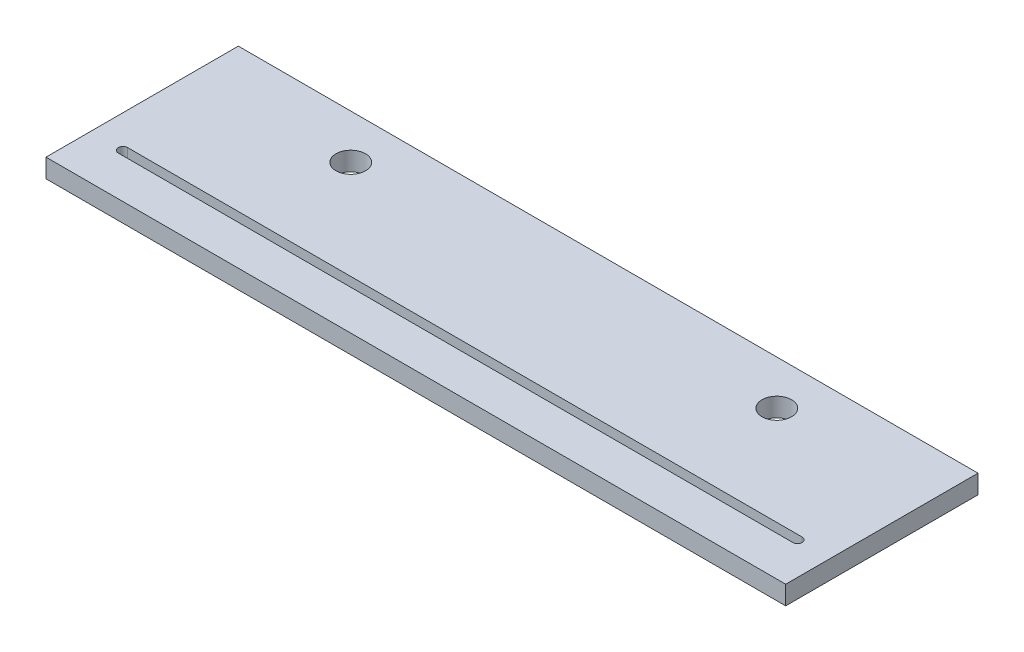
ISO-10303-21;
HEADER;
FILE_DESCRIPTION(('STEP AP214'),'2;1');
FILE_NAME('part.step','',(''),(''),'','','');
FILE_SCHEMA(('AUTOMOTIVE_DESIGN { 1 0 10303 214 1 1 1 1 }'));
ENDSEC;
DATA;
#1=APPLICATION_CONTEXT('core data for automotive mechanical design processes');
#2=APPLICATION_PROTOCOL_DEFINITION('international standard','automotive_design',2000,#1);
#3=PRODUCT_CONTEXT('',#1,'mechanical');
#4=PRODUCT('Part','Part','',(#3));
#5=PRODUCT_RELATED_PRODUCT_CATEGORY('part','',(#4));
#6=PRODUCT_DEFINITION_FORMATION('','',#4);
#7=PRODUCT_DEFINITION_CONTEXT('part definition',#1,'design');
#8=PRODUCT_DEFINITION('design','',#6,#7);
#9=PRODUCT_DEFINITION_SHAPE('','',#8);
#10=(LENGTH_UNIT() NAMED_UNIT(*) SI_UNIT(.MILLI.,.METRE.));
#11=(NAMED_UNIT(*) PLANE_ANGLE_UNIT() SI_UNIT($,.RADIAN.));
#12=(NAMED_UNIT(*) SI_UNIT($,.STERADIAN.) SOLID_ANGLE_UNIT());
#13=UNCERTAINTY_MEASURE_WITH_UNIT(LENGTH_MEASURE(1.E-05),#10,'distance_accuracy_value','');
#14=(GEOMETRIC_REPRESENTATION_CONTEXT(3) GLOBAL_UNCERTAINTY_ASSIGNED_CONTEXT((#13)) GLOBAL_UNIT_ASSIGNED_CONTEXT((#10,
#11,#12)) REPRESENTATION_CONTEXT('',''));
#15=CARTESIAN_POINT('',(0.,0.,0.));
#16=DIRECTION('',(0.,0.,1.));
#17=DIRECTION('',(1.,0.,0.));
#18=AXIS2_PLACEMENT_3D('',#15,#16,#17);
#19=CARTESIAN_POINT('',(-125.,6.35,-25.));
#20=DIRECTION('',(0.,0.,1.));
#21=DIRECTION('',(1.,0.,0.));
#22=AXIS2_PLACEMENT_3D('',#19,#20,#21);
#23=PLANE('',#22);
#24=DIRECTION('',(-1.,0.,0.));
#25=VECTOR('',#24,1.);
#26=CARTESIAN_POINT('',(-125.,0.,-25.));
#27=LINE('',#26,#25);
#28=CARTESIAN_POINT('',(125.,0.,-25.));
#29=VERTEX_POINT('',#28);
#30=CARTESIAN_POINT('',(-125.,0.,-25.));
#31=VERTEX_POINT('',#30);
#32=EDGE_CURVE('E134',#29,#31,#27,.T.);
#33=ORIENTED_EDGE('',*,*,#32,.T.);
#34=DIRECTION('',(0.,-1.,0.));
#35=VECTOR('',#34,1.);
#36=CARTESIAN_POINT('',(-125.,6.35,-25.));
#37=LINE('',#36,#35);
#38=CARTESIAN_POINT('',(-125.,6.35,-25.));
#39=VERTEX_POINT('',#38);
#40=EDGE_CURVE('E40',#39,#31,#37,.T.);
#41=ORIENTED_EDGE('',*,*,#40,.F.);
#42=DIRECTION('',(-1.,0.,0.));
#43=VECTOR('',#42,1.);
#44=CARTESIAN_POINT('',(-125.,6.35,-25.));
#45=LINE('',#44,#43);
#46=CARTESIAN_POINT('',(125.,6.35,-25.));
#47=VERTEX_POINT('',#46);
#48=EDGE_CURVE('E141',#47,#39,#45,.T.);
#49=ORIENTED_EDGE('',*,*,#48,.F.);
#50=DIRECTION('',(0.,-1.,0.));
#51=VECTOR('',#50,1.);
#52=CARTESIAN_POINT('',(125.,6.35,-25.));
#53=LINE('',#52,#51);
#54=EDGE_CURVE('E11',#47,#29,#53,.T.);
#55=ORIENTED_EDGE('',*,*,#54,.T.);
#56=EDGE_LOOP('',(#33,#41,#49,#55));
#57=FACE_BOUND('',#56,.T.);
#58=ADVANCED_FACE('F33',(#57),#23,.F.);
#59=CARTESIAN_POINT('',(-125.,6.35,25.));
#60=DIRECTION('',(1.,0.,0.));
#61=DIRECTION('',(0.,0.,-1.));
#62=AXIS2_PLACEMENT_3D('',#59,#60,#61);
#63=PLANE('',#62);
#64=DIRECTION('',(0.,0.,1.));
#65=VECTOR('',#64,1.);
#66=CARTESIAN_POINT('',(-125.,0.,25.));
#67=LINE('',#66,#65);
#68=CARTESIAN_POINT('',(-125.,0.,40.));
#69=VERTEX_POINT('',#68);
#70=EDGE_CURVE('E152',#31,#69,#67,.T.);
#71=ORIENTED_EDGE('',*,*,#70,.T.);
#72=DIRECTION('',(0.,-1.,0.));
#73=VECTOR('',#72,1.);
#74=CARTESIAN_POINT('',(-125.,6.35,40.));
#75=LINE('',#74,#73);
#76=CARTESIAN_POINT('',(-125.,6.35,40.));
#77=VERTEX_POINT('',#76);
#78=EDGE_CURVE('E159',#77,#69,#75,.T.);
#79=ORIENTED_EDGE('',*,*,#78,.F.);
#80=DIRECTION('',(0.,0.,1.));
#81=VECTOR('',#80,1.);
#82=CARTESIAN_POINT('',(-125.,6.35,25.));
#83=LINE('',#82,#81);
#84=EDGE_CURVE('E144',#39,#77,#83,.T.);
#85=ORIENTED_EDGE('',*,*,#84,.F.);
#86=ORIENTED_EDGE('',*,*,#40,.T.);
#87=EDGE_LOOP('',(#71,#79,#85,#86));
#88=FACE_BOUND('',#87,.T.);
#89=ADVANCED_FACE('F165',(#88),#63,.F.);
#90=CARTESIAN_POINT('',(-125.,6.35,40.));
#91=DIRECTION('',(0.,0.,-1.));
#92=DIRECTION('',(-1.,0.,0.));
#93=AXIS2_PLACEMENT_3D('',#90,#91,#92);
#94=PLANE('',#93);
#95=DIRECTION('',(1.,0.,0.));
#96=VECTOR('',#95,1.);
#97=CARTESIAN_POINT('',(-125.,0.,40.));
#98=LINE('',#97,#96);
#99=CARTESIAN_POINT('',(125.,0.,40.));
#100=VERTEX_POINT('',#99);
#101=EDGE_CURVE('E154',#69,#100,#98,.T.);
#102=ORIENTED_EDGE('',*,*,#101,.T.);
#103=DIRECTION('',(0.,-1.,0.));
#104=VECTOR('',#103,1.);
#105=CARTESIAN_POINT('',(125.,6.35,40.));
#106=LINE('',#105,#104);
#107=CARTESIAN_POINT('',(125.,6.35,40.));
#108=VERTEX_POINT('',#107);
#109=EDGE_CURVE('E149',#108,#100,#106,.T.);
#110=ORIENTED_EDGE('',*,*,#109,.F.);
#111=DIRECTION('',(1.,0.,0.));
#112=VECTOR('',#111,1.);
#113=CARTESIAN_POINT('',(-125.,6.35,40.));
#114=LINE('',#113,#112);
#115=EDGE_CURVE('E146',#77,#108,#114,.T.);
#116=ORIENTED_EDGE('',*,*,#115,.F.);
#117=ORIENTED_EDGE('',*,*,#78,.T.);
#118=EDGE_LOOP('',(#102,#110,#116,#117));
#119=FACE_BOUND('',#118,.T.);
#120=ADVANCED_FACE('F174',(#119),#94,.F.);
#121=CARTESIAN_POINT('',(125.,6.35,40.));
#122=DIRECTION('',(-1.,0.,0.));
#123=DIRECTION('',(0.,0.,1.));
#124=AXIS2_PLACEMENT_3D('',#121,#122,#123);
#125=PLANE('',#124);
#126=DIRECTION('',(0.,0.,-1.));
#127=VECTOR('',#126,1.);
#128=CARTESIAN_POINT('',(125.,0.,40.));
#129=LINE('',#128,#127);
#130=EDGE_CURVE('E142',#100,#29,#129,.T.);
#131=ORIENTED_EDGE('',*,*,#130,.T.);
#132=ORIENTED_EDGE('',*,*,#54,.F.);
#133=DIRECTION('',(0.,0.,-1.));
#134=VECTOR('',#133,1.);
#135=CARTESIAN_POINT('',(125.,6.35,25.));
#136=LINE('',#135,#134);
#137=EDGE_CURVE('E138',#108,#47,#136,.T.);
#138=ORIENTED_EDGE('',*,*,#137,.F.);
#139=ORIENTED_EDGE('',*,*,#109,.T.);
#140=EDGE_LOOP('',(#131,#132,#138,#139));
#141=FACE_BOUND('',#140,.T.);
#142=ADVANCED_FACE('F177',(#141),#125,.F.);
#143=CARTESIAN_POINT('',(0.,6.35,0.));
#144=DIRECTION('',(0.,-1.,0.));
#145=DIRECTION('',(0.,0.,-1.));
#146=AXIS2_PLACEMENT_3D('',#143,#144,#145);
#147=PLANE('',#146);
#148=CARTESIAN_POINT('',(72.,6.35,-10.));
#149=DIRECTION('',(0.,1.,0.));
#150=DIRECTION('',(0.,0.,1.));
#151=AXIS2_PLACEMENT_3D('',#148,#149,#150);
#152=CIRCLE('',#151,5.);
#153=CARTESIAN_POINT('',(72.,6.35,-5.));
#154=VERTEX_POINT('',#153);
#155=EDGE_CURVE('E281',#154,#154,#152,.T.);
#156=ORIENTED_EDGE('',*,*,#155,.F.);
#157=EDGE_LOOP('',(#156));
#158=FACE_BOUND('',#157,.T.);
#159=CARTESIAN_POINT('',(-72.,6.35,-10.));
#160=DIRECTION('',(0.,1.,0.));
#161=DIRECTION('',(0.,0.,1.));
#162=AXIS2_PLACEMENT_3D('',#159,#160,#161);
#163=CIRCLE('',#162,5.);
#164=CARTESIAN_POINT('',(-72.,6.35,-5.));
#165=VERTEX_POINT('',#164);
#166=EDGE_CURVE('E121',#165,#165,#163,.T.);
#167=ORIENTED_EDGE('',*,*,#166,.F.);
#168=EDGE_LOOP('',(#167));
#169=FACE_BOUND('',#168,.T.);
#170=DIRECTION('',(1.,0.,0.));
#171=VECTOR('',#170,1.);
#172=CARTESIAN_POINT('',(-114.,6.35,26.5875));
#173=LINE('',#172,#171);
#174=CARTESIAN_POINT('',(-114.,6.35,26.5875));
#175=VERTEX_POINT('',#174);
#176=CARTESIAN_POINT('',(114.,6.35,26.5875));
#177=VERTEX_POINT('',#176);
#178=EDGE_CURVE('E127',#175,#177,#173,.T.);
#179=ORIENTED_EDGE('',*,*,#178,.F.);
#180=CARTESIAN_POINT('',(-114.,6.35,25.));
#181=DIRECTION('',(0.,1.,0.));
#182=DIRECTION('',(0.,0.,1.));
#183=AXIS2_PLACEMENT_3D('',#180,#181,#182);
#184=CIRCLE('',#183,1.58749999999998);
#185=CARTESIAN_POINT('',(-114.,6.35,23.4125));
#186=VERTEX_POINT('',#185);
#187=EDGE_CURVE('E47',#186,#175,#184,.T.);
#188=ORIENTED_EDGE('',*,*,#187,.F.);
#189=DIRECTION('',(-1.,0.,0.));
#190=VECTOR('',#189,1.);
#191=CARTESIAN_POINT('',(114.,6.35,23.4125));
#192=LINE('',#191,#190);
#193=CARTESIAN_POINT('',(114.,6.35,23.4125));
#194=VERTEX_POINT('',#193);
#195=EDGE_CURVE('E115',#194,#186,#192,.T.);
#196=ORIENTED_EDGE('',*,*,#195,.F.);
#197=CARTESIAN_POINT('',(114.,6.35,25.));
#198=DIRECTION('',(0.,1.,0.));
#199=DIRECTION('',(0.,0.,1.));
#200=AXIS2_PLACEMENT_3D('',#197,#198,#199);
#201=CIRCLE('',#200,1.5875);
#202=EDGE_CURVE('E118',#177,#194,#201,.T.);
#203=ORIENTED_EDGE('',*,*,#202,.F.);
#204=EDGE_LOOP('',(#179,#188,#196,#203));
#205=FACE_BOUND('',#204,.T.);
#206=ORIENTED_EDGE('',*,*,#137,.T.);
#207=ORIENTED_EDGE('',*,*,#48,.T.);
#208=ORIENTED_EDGE('',*,*,#84,.T.);
#209=ORIENTED_EDGE('',*,*,#115,.T.);
#210=EDGE_LOOP('',(#206,#207,#208,#209));
#211=FACE_BOUND('',#210,.T.);
#212=ADVANCED_FACE('F179',(#158,#169,#205,#211),#147,.F.);
#213=CARTESIAN_POINT('',(0.,0.,0.));
#214=DIRECTION('',(0.,-1.,0.));
#215=DIRECTION('',(0.,0.,-1.));
#216=AXIS2_PLACEMENT_3D('',#213,#214,#215);
#217=PLANE('',#216);
#218=CARTESIAN_POINT('',(72.,0.,-10.));
#219=DIRECTION('',(0.,1.,0.));
#220=DIRECTION('',(0.,0.,1.));
#221=AXIS2_PLACEMENT_3D('',#218,#219,#220);
#222=CIRCLE('',#221,5.);
#223=CARTESIAN_POINT('',(72.,0.,-5.));
#224=VERTEX_POINT('',#223);
#225=EDGE_CURVE('E279',#224,#224,#222,.T.);
#226=ORIENTED_EDGE('',*,*,#225,.T.);
#227=EDGE_LOOP('',(#226));
#228=FACE_BOUND('',#227,.T.);
#229=CARTESIAN_POINT('',(-72.,0.,-10.));
#230=DIRECTION('',(0.,1.,0.));
#231=DIRECTION('',(0.,0.,1.));
#232=AXIS2_PLACEMENT_3D('',#229,#230,#231);
#233=CIRCLE('',#232,5.);
#234=CARTESIAN_POINT('',(-72.,0.,-5.));
#235=VERTEX_POINT('',#234);
#236=EDGE_CURVE('E128',#235,#235,#233,.T.);
#237=ORIENTED_EDGE('',*,*,#236,.T.);
#238=EDGE_LOOP('',(#237));
#239=FACE_BOUND('',#238,.T.);
#240=CARTESIAN_POINT('',(-114.,0.,25.));
#241=DIRECTION('',(0.,1.,0.));
#242=DIRECTION('',(0.,0.,1.));
#243=AXIS2_PLACEMENT_3D('',#240,#241,#242);
#244=CIRCLE('',#243,1.58749999999998);
#245=CARTESIAN_POINT('',(-114.,0.,23.4125));
#246=VERTEX_POINT('',#245);
#247=CARTESIAN_POINT('',(-114.,0.,26.5875));
#248=VERTEX_POINT('',#247);
#249=EDGE_CURVE('E99',#246,#248,#244,.T.);
#250=ORIENTED_EDGE('',*,*,#249,.T.);
#251=DIRECTION('',(1.,0.,0.));
#252=VECTOR('',#251,1.);
#253=CARTESIAN_POINT('',(-114.,0.,26.5875));
#254=LINE('',#253,#252);
#255=CARTESIAN_POINT('',(114.,0.,26.5875));
#256=VERTEX_POINT('',#255);
#257=EDGE_CURVE('E108',#248,#256,#254,.T.);
#258=ORIENTED_EDGE('',*,*,#257,.T.);
#259=CARTESIAN_POINT('',(114.,0.,25.));
#260=DIRECTION('',(0.,1.,0.));
#261=DIRECTION('',(0.,0.,1.));
#262=AXIS2_PLACEMENT_3D('',#259,#260,#261);
#263=CIRCLE('',#262,1.5875);
#264=CARTESIAN_POINT('',(114.,0.,23.4125));
#265=VERTEX_POINT('',#264);
#266=EDGE_CURVE('E55',#256,#265,#263,.T.);
#267=ORIENTED_EDGE('',*,*,#266,.T.);
#268=DIRECTION('',(-1.,0.,0.));
#269=VECTOR('',#268,1.);
#270=CARTESIAN_POINT('',(114.,0.,23.4125));
#271=LINE('',#270,#269);
#272=EDGE_CURVE('E105',#265,#246,#271,.T.);
#273=ORIENTED_EDGE('',*,*,#272,.T.);
#274=EDGE_LOOP('',(#250,#258,#267,#273));
#275=FACE_BOUND('',#274,.T.);
#276=ORIENTED_EDGE('',*,*,#32,.F.);
#277=ORIENTED_EDGE('',*,*,#130,.F.);
#278=ORIENTED_EDGE('',*,*,#101,.F.);
#279=ORIENTED_EDGE('',*,*,#70,.F.);
#280=EDGE_LOOP('',(#276,#277,#278,#279));
#281=FACE_BOUND('',#280,.T.);
#282=ADVANCED_FACE('F112',(#228,#239,#275,#281),#217,.T.);
#283=CARTESIAN_POINT('',(-114.,0.,25.));
#284=DIRECTION('',(0.,1.,0.));
#285=DIRECTION('',(0.,0.,1.));
#286=AXIS2_PLACEMENT_3D('',#283,#284,#285);
#287=CYLINDRICAL_SURFACE('',#286,1.58749999999998);
#288=ORIENTED_EDGE('',*,*,#187,.T.);
#289=DIRECTION('',(0.,1.,0.));
#290=VECTOR('',#289,1.);
#291=CARTESIAN_POINT('',(-114.,0.,26.5875));
#292=LINE('',#291,#290);
#293=EDGE_CURVE('E95',#248,#175,#292,.T.);
#294=ORIENTED_EDGE('',*,*,#293,.F.);
#295=ORIENTED_EDGE('',*,*,#249,.F.);
#296=DIRECTION('',(0.,1.,0.));
#297=VECTOR('',#296,1.);
#298=CARTESIAN_POINT('',(-114.,0.,23.4125));
#299=LINE('',#298,#297);
#300=EDGE_CURVE('E132',#246,#186,#299,.T.);
#301=ORIENTED_EDGE('',*,*,#300,.T.);
#302=EDGE_LOOP('',(#288,#294,#295,#301));
#303=FACE_BOUND('',#302,.T.);
#304=ADVANCED_FACE('F97',(#303),#287,.F.);
#305=CARTESIAN_POINT('',(114.,0.,23.4125));
#306=DIRECTION('',(0.,0.,-1.));
#307=DIRECTION('',(-1.,0.,0.));
#308=AXIS2_PLACEMENT_3D('',#305,#306,#307);
#309=PLANE('',#308);
#310=ORIENTED_EDGE('',*,*,#195,.T.);
#311=ORIENTED_EDGE('',*,*,#300,.F.);
#312=ORIENTED_EDGE('',*,*,#272,.F.);
#313=DIRECTION('',(0.,1.,0.));
#314=VECTOR('',#313,1.);
#315=CARTESIAN_POINT('',(114.,0.,23.4125));
#316=LINE('',#315,#314);
#317=EDGE_CURVE('E135',#265,#194,#316,.T.);
#318=ORIENTED_EDGE('',*,*,#317,.T.);
#319=EDGE_LOOP('',(#310,#311,#312,#318));
#320=FACE_BOUND('',#319,.T.);
#321=ADVANCED_FACE('F227',(#320),#309,.F.);
#322=CARTESIAN_POINT('',(114.,0.,25.));
#323=DIRECTION('',(0.,1.,0.));
#324=DIRECTION('',(0.,0.,1.));
#325=AXIS2_PLACEMENT_3D('',#322,#323,#324);
#326=CYLINDRICAL_SURFACE('',#325,1.5875);
#327=ORIENTED_EDGE('',*,*,#202,.T.);
#328=ORIENTED_EDGE('',*,*,#317,.F.);
#329=ORIENTED_EDGE('',*,*,#266,.F.);
#330=DIRECTION('',(0.,1.,0.));
#331=VECTOR('',#330,1.);
#332=CARTESIAN_POINT('',(114.,0.,26.5875));
#333=LINE('',#332,#331);
#334=EDGE_CURVE('E104',#256,#177,#333,.T.);
#335=ORIENTED_EDGE('',*,*,#334,.T.);
#336=EDGE_LOOP('',(#327,#328,#329,#335));
#337=FACE_BOUND('',#336,.T.);
#338=ADVANCED_FACE('F235',(#337),#326,.F.);
#339=CARTESIAN_POINT('',(-114.,0.,26.5875));
#340=DIRECTION('',(0.,0.,1.));
#341=DIRECTION('',(1.,0.,0.));
#342=AXIS2_PLACEMENT_3D('',#339,#340,#341);
#343=PLANE('',#342);
#344=ORIENTED_EDGE('',*,*,#178,.T.);
#345=ORIENTED_EDGE('',*,*,#334,.F.);
#346=ORIENTED_EDGE('',*,*,#257,.F.);
#347=ORIENTED_EDGE('',*,*,#293,.T.);
#348=EDGE_LOOP('',(#344,#345,#346,#347));
#349=FACE_BOUND('',#348,.T.);
#350=ADVANCED_FACE('F109',(#349),#343,.F.);
#351=CARTESIAN_POINT('',(-72.,0.,-10.));
#352=DIRECTION('',(0.,1.,0.));
#353=DIRECTION('',(0.,0.,1.));
#354=AXIS2_PLACEMENT_3D('',#351,#352,#353);
#355=CYLINDRICAL_SURFACE('',#354,5.);
#356=ORIENTED_EDGE('',*,*,#236,.F.);
#357=EDGE_LOOP('',(#356));
#358=FACE_BOUND('',#357,.T.);
#359=ORIENTED_EDGE('',*,*,#166,.T.);
#360=EDGE_LOOP('',(#359));
#361=FACE_BOUND('',#360,.T.);
#362=ADVANCED_FACE('F253',(#358,#361),#355,.F.);
#363=CARTESIAN_POINT('',(72.,0.,-10.));
#364=DIRECTION('',(0.,1.,0.));
#365=DIRECTION('',(0.,0.,1.));
#366=AXIS2_PLACEMENT_3D('',#363,#364,#365);
#367=CYLINDRICAL_SURFACE('',#366,5.);
#368=ORIENTED_EDGE('',*,*,#225,.F.);
#369=EDGE_LOOP('',(#368));
#370=FACE_BOUND('',#369,.T.);
#371=ORIENTED_EDGE('',*,*,#155,.T.);
#372=EDGE_LOOP('',(#371));
#373=FACE_BOUND('',#372,.T.);
#374=ADVANCED_FACE('F262',(#370,#373),#367,.F.);
#375=CLOSED_SHELL('',(#58,#89,#120,#142,#212,#282,#304,#321,#338,#350,#362,#374));
#376=MANIFOLD_SOLID_BREP('B2',#375);
#377=ADVANCED_BREP_SHAPE_REPRESENTATION('',(#18,#376),#14);
#378=SHAPE_DEFINITION_REPRESENTATION(#9,#377);
ENDSEC;
END-ISO-10303-21;
